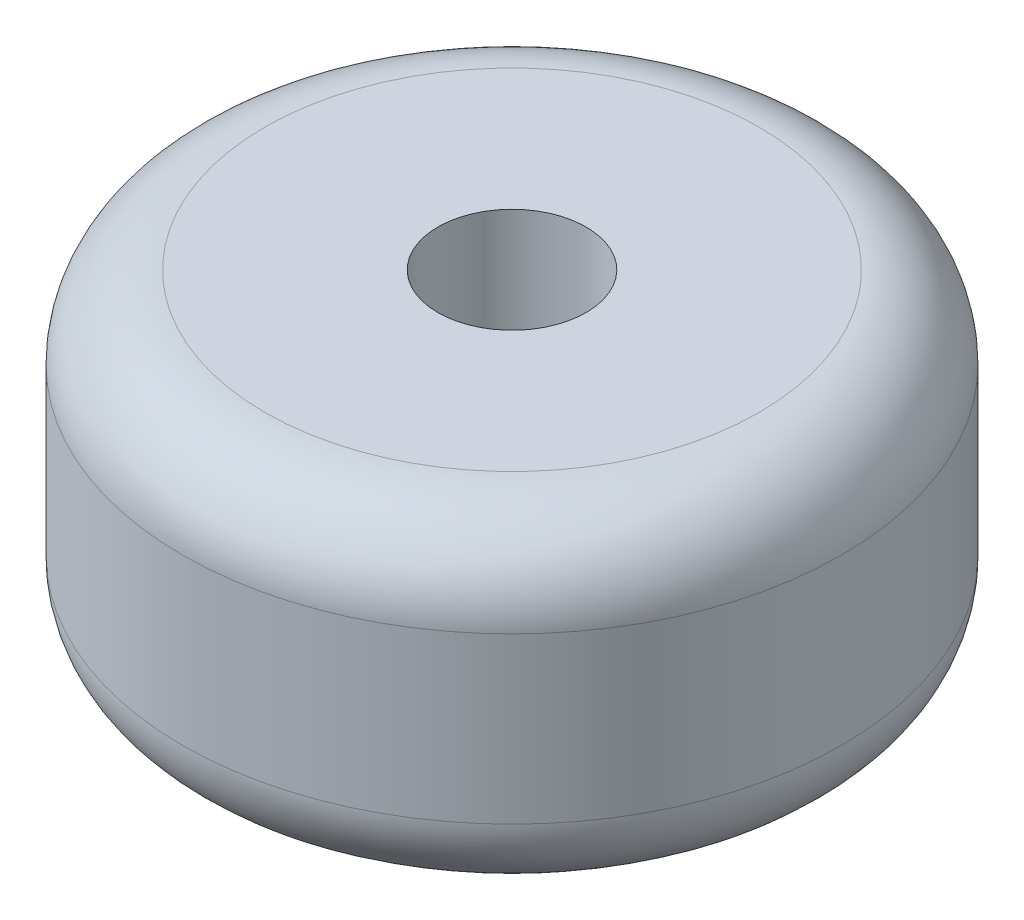
ISO-10303-21;
HEADER;
FILE_DESCRIPTION(('STEP AP214'),'2;1');
FILE_NAME('part.step','',(''),(''),'','','');
FILE_SCHEMA(('AUTOMOTIVE_DESIGN { 1 0 10303 214 1 1 1 1 }'));
ENDSEC;
DATA;
#1=APPLICATION_CONTEXT('core data for automotive mechanical design processes');
#2=APPLICATION_PROTOCOL_DEFINITION('international standard','automotive_design',2000,#1);
#3=PRODUCT_CONTEXT('',#1,'mechanical');
#4=PRODUCT('Part','Part','',(#3));
#5=PRODUCT_RELATED_PRODUCT_CATEGORY('part','',(#4));
#6=PRODUCT_DEFINITION_FORMATION('','',#4);
#7=PRODUCT_DEFINITION_CONTEXT('part definition',#1,'design');
#8=PRODUCT_DEFINITION('design','',#6,#7);
#9=PRODUCT_DEFINITION_SHAPE('','',#8);
#10=(LENGTH_UNIT() NAMED_UNIT(*) SI_UNIT(.MILLI.,.METRE.));
#11=(NAMED_UNIT(*) PLANE_ANGLE_UNIT() SI_UNIT($,.RADIAN.));
#12=(NAMED_UNIT(*) SI_UNIT($,.STERADIAN.) SOLID_ANGLE_UNIT());
#13=UNCERTAINTY_MEASURE_WITH_UNIT(LENGTH_MEASURE(1.E-05),#10,'distance_accuracy_value','');
#14=(GEOMETRIC_REPRESENTATION_CONTEXT(3) GLOBAL_UNCERTAINTY_ASSIGNED_CONTEXT((#13)) GLOBAL_UNIT_ASSIGNED_CONTEXT((#10,
#11,#12)) REPRESENTATION_CONTEXT('',''));
#15=CARTESIAN_POINT('',(0.,0.,0.));
#16=DIRECTION('',(0.,0.,1.));
#17=DIRECTION('',(1.,0.,0.));
#18=AXIS2_PLACEMENT_3D('',#15,#16,#17);
#19=CARTESIAN_POINT('',(0.,2.,0.));
#20=DIRECTION('',(0.,-1.,0.));
#21=DIRECTION('',(0.,0.,-1.));
#22=AXIS2_PLACEMENT_3D('',#19,#20,#21);
#23=CYLINDRICAL_SURFACE('',#22,2.);
#24=CARTESIAN_POINT('',(0.,0.5,0.));
#25=DIRECTION('',(0.,1.,0.));
#26=DIRECTION('',(0.,0.,1.));
#27=AXIS2_PLACEMENT_3D('',#24,#25,#26);
#28=CIRCLE('',#27,2.);
#29=CARTESIAN_POINT('',(0.,0.5,2.));
#30=VERTEX_POINT('',#29);
#31=EDGE_CURVE('E50',#30,#30,#28,.T.);
#32=ORIENTED_EDGE('',*,*,#31,.T.);
#33=EDGE_LOOP('',(#32));
#34=FACE_BOUND('',#33,.T.);
#35=CARTESIAN_POINT('',(0.,1.5,0.));
#36=DIRECTION('',(0.,1.,0.));
#37=DIRECTION('',(0.,0.,1.));
#38=AXIS2_PLACEMENT_3D('',#35,#36,#37);
#39=CIRCLE('',#38,2.);
#40=CARTESIAN_POINT('',(0.,1.5,2.));
#41=VERTEX_POINT('',#40);
#42=EDGE_CURVE('E55',#41,#41,#39,.F.);
#43=ORIENTED_EDGE('',*,*,#42,.T.);
#44=EDGE_LOOP('',(#43));
#45=FACE_BOUND('',#44,.T.);
#46=ADVANCED_FACE('F37',(#34,#45),#23,.T.);
#47=CARTESIAN_POINT('',(0.,2.,0.));
#48=DIRECTION('',(0.,1.,0.));
#49=DIRECTION('',(0.,0.,1.));
#50=AXIS2_PLACEMENT_3D('',#47,#48,#49);
#51=PLANE('',#50);
#52=CARTESIAN_POINT('',(0.,2.,0.));
#53=DIRECTION('',(0.,1.,0.));
#54=DIRECTION('',(0.,0.,1.));
#55=AXIS2_PLACEMENT_3D('',#52,#53,#54);
#56=CIRCLE('',#55,1.5);
#57=CARTESIAN_POINT('',(0.,2.,1.5));
#58=VERTEX_POINT('',#57);
#59=EDGE_CURVE('E10',#58,#58,#56,.T.);
#60=ORIENTED_EDGE('',*,*,#59,.T.);
#61=EDGE_LOOP('',(#60));
#62=FACE_BOUND('',#61,.T.);
#63=CARTESIAN_POINT('',(0.,2.,0.));
#64=DIRECTION('',(0.,1.,0.));
#65=DIRECTION('',(0.,0.,1.));
#66=AXIS2_PLACEMENT_3D('',#63,#64,#65);
#67=CIRCLE('',#66,0.45);
#68=CARTESIAN_POINT('',(0.,2.,0.45));
#69=VERTEX_POINT('',#68);
#70=EDGE_CURVE('E62',#69,#69,#67,.T.);
#71=ORIENTED_EDGE('',*,*,#70,.F.);
#72=EDGE_LOOP('',(#71));
#73=FACE_BOUND('',#72,.T.);
#74=ADVANCED_FACE('F79',(#62,#73),#51,.T.);
#75=CARTESIAN_POINT('',(0.,0.,0.));
#76=DIRECTION('',(0.,1.,0.));
#77=DIRECTION('',(0.,0.,1.));
#78=AXIS2_PLACEMENT_3D('',#75,#76,#77);
#79=PLANE('',#78);
#80=CARTESIAN_POINT('',(0.,0.,0.));
#81=DIRECTION('',(0.,1.,0.));
#82=DIRECTION('',(0.,0.,1.));
#83=AXIS2_PLACEMENT_3D('',#80,#81,#82);
#84=CIRCLE('',#83,1.5);
#85=CARTESIAN_POINT('',(0.,0.,1.5));
#86=VERTEX_POINT('',#85);
#87=EDGE_CURVE('E45',#86,#86,#84,.F.);
#88=ORIENTED_EDGE('',*,*,#87,.T.);
#89=EDGE_LOOP('',(#88));
#90=FACE_BOUND('',#89,.T.);
#91=CARTESIAN_POINT('',(0.,0.,0.));
#92=DIRECTION('',(0.,1.,0.));
#93=DIRECTION('',(0.,0.,1.));
#94=AXIS2_PLACEMENT_3D('',#91,#92,#93);
#95=CIRCLE('',#94,0.45);
#96=CARTESIAN_POINT('',(0.,0.,0.45));
#97=VERTEX_POINT('',#96);
#98=EDGE_CURVE('E61',#97,#97,#95,.T.);
#99=ORIENTED_EDGE('',*,*,#98,.T.);
#100=EDGE_LOOP('',(#99));
#101=FACE_BOUND('',#100,.T.);
#102=ADVANCED_FACE('F70',(#90,#101),#79,.F.);
#103=CARTESIAN_POINT('',(0.,0.,0.));
#104=DIRECTION('',(0.,1.,0.));
#105=DIRECTION('',(0.,0.,1.));
#106=AXIS2_PLACEMENT_3D('',#103,#104,#105);
#107=CYLINDRICAL_SURFACE('',#106,0.45);
#108=ORIENTED_EDGE('',*,*,#98,.F.);
#109=EDGE_LOOP('',(#108));
#110=FACE_BOUND('',#109,.T.);
#111=ORIENTED_EDGE('',*,*,#70,.T.);
#112=EDGE_LOOP('',(#111));
#113=FACE_BOUND('',#112,.T.);
#114=ADVANCED_FACE('F72',(#110,#113),#107,.F.);
#115=CARTESIAN_POINT('',(0.,0.5,0.));
#116=DIRECTION('',(0.,1.,0.));
#117=DIRECTION('',(0.,0.,1.));
#118=AXIS2_PLACEMENT_3D('',#115,#116,#117);
#119=TOROIDAL_SURFACE('',#118,1.5,0.5);
#120=ORIENTED_EDGE('',*,*,#87,.F.);
#121=EDGE_LOOP('',(#120));
#122=FACE_BOUND('',#121,.T.);
#123=ORIENTED_EDGE('',*,*,#31,.F.);
#124=EDGE_LOOP('',(#123));
#125=FACE_BOUND('',#124,.T.);
#126=ADVANCED_FACE('F75',(#122,#125),#119,.T.);
#127=CARTESIAN_POINT('',(0.,1.5,0.));
#128=DIRECTION('',(0.,1.,0.));
#129=DIRECTION('',(0.,0.,1.));
#130=AXIS2_PLACEMENT_3D('',#127,#128,#129);
#131=TOROIDAL_SURFACE('',#130,1.5,0.5);
#132=ORIENTED_EDGE('',*,*,#42,.F.);
#133=EDGE_LOOP('',(#132));
#134=FACE_BOUND('',#133,.T.);
#135=ORIENTED_EDGE('',*,*,#59,.F.);
#136=EDGE_LOOP('',(#135));
#137=FACE_BOUND('',#136,.T.);
#138=ADVANCED_FACE('F39',(#134,#137),#131,.T.);
#139=CLOSED_SHELL('',(#46,#74,#102,#114,#126,#138));
#140=MANIFOLD_SOLID_BREP('B2',#139);
#141=ADVANCED_BREP_SHAPE_REPRESENTATION('',(#18,#140),#14);
#142=SHAPE_DEFINITION_REPRESENTATION(#9,#141);
ENDSEC;
END-ISO-10303-21;
